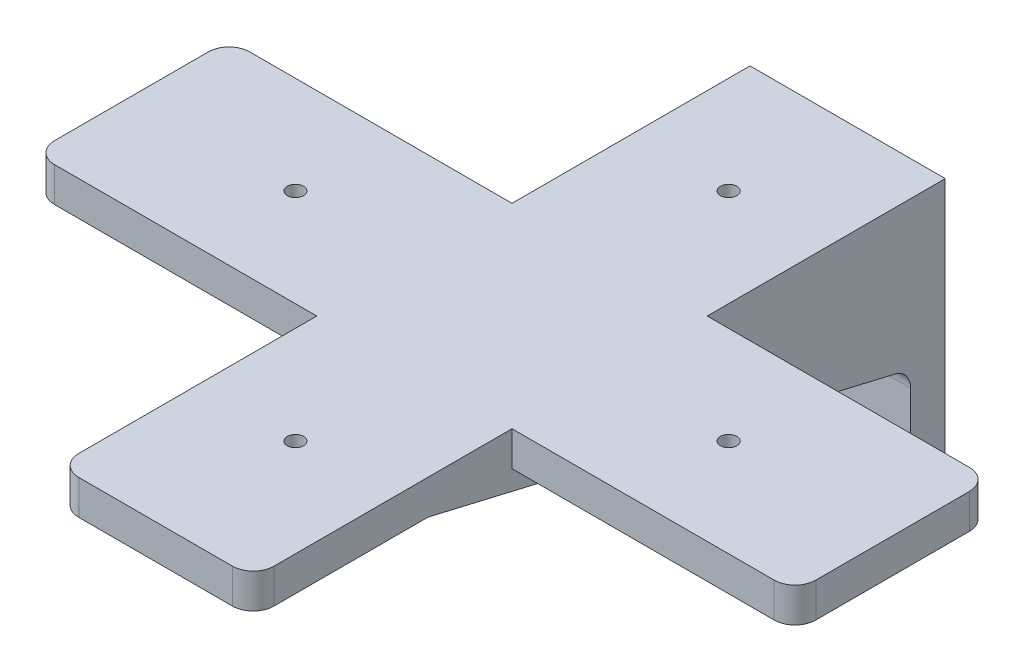
ISO-10303-21;
HEADER;
FILE_DESCRIPTION(('STEP AP214'),'2;1');
FILE_NAME('part.step','',(''),(''),'','','');
FILE_SCHEMA(('AUTOMOTIVE_DESIGN { 1 0 10303 214 1 1 1 1 }'));
ENDSEC;
DATA;
#1=APPLICATION_CONTEXT('core data for automotive mechanical design processes');
#2=APPLICATION_PROTOCOL_DEFINITION('international standard','automotive_design',2000,#1);
#3=PRODUCT_CONTEXT('',#1,'mechanical');
#4=PRODUCT('Part','Part','',(#3));
#5=PRODUCT_RELATED_PRODUCT_CATEGORY('part','',(#4));
#6=PRODUCT_DEFINITION_FORMATION('','',#4);
#7=PRODUCT_DEFINITION_CONTEXT('part definition',#1,'design');
#8=PRODUCT_DEFINITION('design','',#6,#7);
#9=PRODUCT_DEFINITION_SHAPE('','',#8);
#10=(LENGTH_UNIT() NAMED_UNIT(*) SI_UNIT(.MILLI.,.METRE.));
#11=(NAMED_UNIT(*) PLANE_ANGLE_UNIT() SI_UNIT($,.RADIAN.));
#12=(NAMED_UNIT(*) SI_UNIT($,.STERADIAN.) SOLID_ANGLE_UNIT());
#13=UNCERTAINTY_MEASURE_WITH_UNIT(LENGTH_MEASURE(1.E-05),#10,'distance_accuracy_value','');
#14=(GEOMETRIC_REPRESENTATION_CONTEXT(3) GLOBAL_UNCERTAINTY_ASSIGNED_CONTEXT((#13)) GLOBAL_UNIT_ASSIGNED_CONTEXT((#10,
#11,#12)) REPRESENTATION_CONTEXT('',''));
#15=CARTESIAN_POINT('',(0.,0.,0.));
#16=DIRECTION('',(0.,0.,1.));
#17=DIRECTION('',(1.,0.,0.));
#18=AXIS2_PLACEMENT_3D('',#15,#16,#17);
#19=CARTESIAN_POINT('',(0.,0.,6.35));
#20=DIRECTION('',(0.,0.,-1.));
#21=DIRECTION('',(-1.,0.,0.));
#22=AXIS2_PLACEMENT_3D('',#19,#20,#21);
#23=PLANE('',#22);
#24=DIRECTION('',(0.,-1.,0.));
#25=VECTOR('',#24,1.);
#26=CARTESIAN_POINT('',(-17.91335,-27.12085,6.35));
#27=LINE('',#26,#25);
#28=CARTESIAN_POINT('',(-17.91335,-3.01976470411475,6.35));
#29=VERTEX_POINT('',#28);
#30=CARTESIAN_POINT('',(-17.91335,-23.31085,6.35));
#31=VERTEX_POINT('',#30);
#32=EDGE_CURVE('E362',#29,#31,#27,.T.);
#33=ORIENTED_EDGE('',*,*,#32,.T.);
#34=CARTESIAN_POINT('',(-14.10335,-23.31085,6.35));
#35=DIRECTION('',(0.,0.,-1.));
#36=DIRECTION('',(-1.,0.,0.));
#37=AXIS2_PLACEMENT_3D('',#34,#35,#36);
#38=CIRCLE('',#37,3.81);
#39=CARTESIAN_POINT('',(-14.10335,-27.12085,6.35));
#40=VERTEX_POINT('',#39);
#41=EDGE_CURVE('E408',#31,#40,#38,.F.);
#42=ORIENTED_EDGE('',*,*,#41,.T.);
#43=DIRECTION('',(1.,0.,0.));
#44=VECTOR('',#43,1.);
#45=CARTESIAN_POINT('',(-17.91335,-27.12085,6.35));
#46=LINE('',#45,#44);
#47=CARTESIAN_POINT('',(14.10335,-27.12085,6.35));
#48=VERTEX_POINT('',#47);
#49=EDGE_CURVE('E366',#40,#48,#46,.T.);
#50=ORIENTED_EDGE('',*,*,#49,.T.);
#51=CARTESIAN_POINT('',(14.10335,-23.31085,6.35));
#52=DIRECTION('',(0.,0.,-1.));
#53=DIRECTION('',(-1.,0.,0.));
#54=AXIS2_PLACEMENT_3D('',#51,#52,#53);
#55=CIRCLE('',#54,3.81);
#56=CARTESIAN_POINT('',(17.91335,-23.31085,6.35));
#57=VERTEX_POINT('',#56);
#58=EDGE_CURVE('E406',#48,#57,#55,.F.);
#59=ORIENTED_EDGE('',*,*,#58,.T.);
#60=DIRECTION('',(0.,1.,0.));
#61=VECTOR('',#60,1.);
#62=CARTESIAN_POINT('',(17.91335,-27.12085,6.35));
#63=LINE('',#62,#61);
#64=CARTESIAN_POINT('',(17.91335,-3.01976470411475,6.35));
#65=VERTEX_POINT('',#64);
#66=EDGE_CURVE('E359',#57,#65,#63,.T.);
#67=ORIENTED_EDGE('',*,*,#66,.T.);
#68=DIRECTION('',(1.,0.,0.));
#69=VECTOR('',#68,1.);
#70=CARTESIAN_POINT('',(0.,-3.01976470411475,6.35));
#71=LINE('',#70,#69);
#72=CARTESIAN_POINT('',(12.83335,-3.01976470411475,6.35));
#73=VERTEX_POINT('',#72);
#74=EDGE_CURVE('E403',#65,#73,#71,.F.);
#75=ORIENTED_EDGE('',*,*,#74,.T.);
#76=DIRECTION('',(0.,1.,0.));
#77=VECTOR('',#76,1.);
#78=CARTESIAN_POINT('',(12.83335,20.77085,6.35));
#79=LINE('',#78,#77);
#80=CARTESIAN_POINT('',(12.83335,20.77085,6.35));
#81=VERTEX_POINT('',#80);
#82=EDGE_CURVE('E333',#73,#81,#79,.T.);
#83=ORIENTED_EDGE('',*,*,#82,.T.);
#84=DIRECTION('',(-1.,0.,0.));
#85=VECTOR('',#84,1.);
#86=CARTESIAN_POINT('',(0.,20.77085,6.35));
#87=LINE('',#86,#85);
#88=CARTESIAN_POINT('',(-12.83335,20.77085,6.35));
#89=VERTEX_POINT('',#88);
#90=EDGE_CURVE('E353',#81,#89,#87,.T.);
#91=ORIENTED_EDGE('',*,*,#90,.T.);
#92=DIRECTION('',(0.,1.,0.));
#93=VECTOR('',#92,1.);
#94=CARTESIAN_POINT('',(-12.83335,20.77085,6.35));
#95=LINE('',#94,#93);
#96=CARTESIAN_POINT('',(-12.83335,-3.01976470411475,6.35));
#97=VERTEX_POINT('',#96);
#98=EDGE_CURVE('E323',#97,#89,#95,.T.);
#99=ORIENTED_EDGE('',*,*,#98,.F.);
#100=DIRECTION('',(-1.,0.,0.));
#101=VECTOR('',#100,1.);
#102=CARTESIAN_POINT('',(-17.91335,-3.01976470411475,6.35));
#103=LINE('',#102,#101);
#104=EDGE_CURVE('E400',#97,#29,#103,.T.);
#105=ORIENTED_EDGE('',*,*,#104,.T.);
#106=EDGE_LOOP('',(#33,#42,#50,#59,#67,#75,#83,#91,#99,#105));
#107=FACE_BOUND('',#106,.T.);
#108=ADVANCED_FACE('F33',(#107),#23,.F.);
#109=CARTESIAN_POINT('',(0.,20.77085,0.));
#110=DIRECTION('',(0.,-1.,0.));
#111=DIRECTION('',(0.,0.,-1.));
#112=AXIS2_PLACEMENT_3D('',#109,#110,#111);
#113=PLANE('',#112);
#114=CARTESIAN_POINT('',(1.96755585373371E-12,20.77085,101.349175));
#115=DIRECTION('',(0.,1.,0.));
#116=DIRECTION('',(0.,0.,1.));
#117=AXIS2_PLACEMENT_3D('',#114,#115,#116);
#118=CIRCLE('',#117,1.4986);
#119=CARTESIAN_POINT('',(1.96755585373371E-12,20.77085,102.847775));
#120=VERTEX_POINT('',#119);
#121=EDGE_CURVE('E889',#120,#120,#118,.T.);
#122=ORIENTED_EDGE('',*,*,#121,.T.);
#123=EDGE_LOOP('',(#122));
#124=FACE_BOUND('',#123,.T.);
#125=CARTESIAN_POINT('',(0.,20.77085,21.840825));
#126=DIRECTION('',(0.,1.,0.));
#127=DIRECTION('',(0.,0.,1.));
#128=AXIS2_PLACEMENT_3D('',#125,#126,#127);
#129=CIRCLE('',#128,1.4986);
#130=CARTESIAN_POINT('',(0.,20.77085,23.339425));
#131=VERTEX_POINT('',#130);
#132=EDGE_CURVE('E284',#131,#131,#129,.T.);
#133=ORIENTED_EDGE('',*,*,#132,.T.);
#134=EDGE_LOOP('',(#133));
#135=FACE_BOUND('',#134,.T.);
#136=DIRECTION('',(0.,0.,1.));
#137=VECTOR('',#136,1.);
#138=CARTESIAN_POINT('',(12.83335,20.77085,94.9064462382413));
#139=LINE('',#138,#137);
#140=CARTESIAN_POINT('',(12.83335,20.77085,95.3472808215336));
#141=VERTEX_POINT('',#140);
#142=EDGE_CURVE('E336',#81,#141,#139,.T.);
#143=ORIENTED_EDGE('',*,*,#142,.T.);
#144=DIRECTION('',(1.,0.,0.));
#145=VECTOR('',#144,1.);
#146=CARTESIAN_POINT('',(17.91335,20.77085,95.3472808215336));
#147=LINE('',#146,#145);
#148=CARTESIAN_POINT('',(17.91335,20.77085,95.3472808215336));
#149=VERTEX_POINT('',#148);
#150=EDGE_CURVE('E427',#141,#149,#147,.T.);
#151=ORIENTED_EDGE('',*,*,#150,.T.);
#152=DIRECTION('',(0.,0.,-1.));
#153=VECTOR('',#152,1.);
#154=CARTESIAN_POINT('',(17.91335,20.77085,127.));
#155=LINE('',#154,#153);
#156=CARTESIAN_POINT('',(17.91335,20.77085,123.19));
#157=VERTEX_POINT('',#156);
#158=EDGE_CURVE('E350',#157,#149,#155,.T.);
#159=ORIENTED_EDGE('',*,*,#158,.F.);
#160=CARTESIAN_POINT('',(14.10335,20.77085,123.19));
#161=DIRECTION('',(0.,-1.,0.));
#162=DIRECTION('',(0.,0.,-1.));
#163=AXIS2_PLACEMENT_3D('',#160,#161,#162);
#164=CIRCLE('',#163,3.81);
#165=CARTESIAN_POINT('',(14.10335,20.77085,127.));
#166=VERTEX_POINT('',#165);
#167=EDGE_CURVE('E432',#157,#166,#164,.T.);
#168=ORIENTED_EDGE('',*,*,#167,.T.);
#169=DIRECTION('',(1.,0.,0.));
#170=VECTOR('',#169,1.);
#171=CARTESIAN_POINT('',(-17.91335,20.77085,127.));
#172=LINE('',#171,#170);
#173=CARTESIAN_POINT('',(-14.10335,20.77085,127.));
#174=VERTEX_POINT('',#173);
#175=EDGE_CURVE('E347',#174,#166,#172,.T.);
#176=ORIENTED_EDGE('',*,*,#175,.F.);
#177=CARTESIAN_POINT('',(-14.10335,20.77085,123.19));
#178=DIRECTION('',(0.,-1.,0.));
#179=DIRECTION('',(0.,0.,-1.));
#180=AXIS2_PLACEMENT_3D('',#177,#178,#179);
#181=CIRCLE('',#180,3.81);
#182=CARTESIAN_POINT('',(-17.91335,20.77085,123.19));
#183=VERTEX_POINT('',#182);
#184=EDGE_CURVE('E430',#174,#183,#181,.T.);
#185=ORIENTED_EDGE('',*,*,#184,.T.);
#186=DIRECTION('',(0.,0.,1.));
#187=VECTOR('',#186,1.);
#188=CARTESIAN_POINT('',(-17.91335,20.77085,127.));
#189=LINE('',#188,#187);
#190=CARTESIAN_POINT('',(-17.91335,20.77085,95.3472808215336));
#191=VERTEX_POINT('',#190);
#192=EDGE_CURVE('E344',#191,#183,#189,.T.);
#193=ORIENTED_EDGE('',*,*,#192,.F.);
#194=DIRECTION('',(-1.,0.,0.));
#195=VECTOR('',#194,1.);
#196=CARTESIAN_POINT('',(0.,20.77085,95.3472808215336));
#197=LINE('',#196,#195);
#198=CARTESIAN_POINT('',(-12.83335,20.77085,95.3472808215336));
#199=VERTEX_POINT('',#198);
#200=EDGE_CURVE('E424',#191,#199,#197,.F.);
#201=ORIENTED_EDGE('',*,*,#200,.T.);
#202=DIRECTION('',(0.,0.,1.));
#203=VECTOR('',#202,1.);
#204=CARTESIAN_POINT('',(-12.83335,20.77085,94.9064462382413));
#205=LINE('',#204,#203);
#206=EDGE_CURVE('E328',#89,#199,#205,.T.);
#207=ORIENTED_EDGE('',*,*,#206,.F.);
#208=ORIENTED_EDGE('',*,*,#90,.F.);
#209=EDGE_LOOP('',(#143,#151,#159,#168,#176,#185,#193,#201,#207,#208));
#210=FACE_BOUND('',#209,.T.);
#211=ADVANCED_FACE('F515',(#124,#135,#210),#113,.T.);
#212=CARTESIAN_POINT('',(17.91335,-27.12085,6.35));
#213=DIRECTION('',(-1.,0.,0.));
#214=DIRECTION('',(0.,0.,1.));
#215=AXIS2_PLACEMENT_3D('',#212,#213,#214);
#216=PLANE('',#215);
#217=DIRECTION('',(0.,0.,-1.));
#218=VECTOR('',#217,1.);
#219=CARTESIAN_POINT('',(17.91335,20.77085,6.35));
#220=LINE('',#219,#218);
#221=CARTESIAN_POINT('',(17.91335,20.77085,79.50835));
#222=VERTEX_POINT('',#221);
#223=CARTESIAN_POINT('',(17.91335,20.77085,43.68165));
#224=VERTEX_POINT('',#223);
#225=EDGE_CURVE('E314',#222,#224,#220,.T.);
#226=ORIENTED_EDGE('',*,*,#225,.F.);
#227=DIRECTION('',(0.,1.,0.));
#228=VECTOR('',#227,1.);
#229=CARTESIAN_POINT('',(17.91335,-27.12085,79.50835));
#230=LINE('',#229,#228);
#231=CARTESIAN_POINT('',(17.91335,27.12085,79.50835));
#232=VERTEX_POINT('',#231);
#233=EDGE_CURVE('E319',#222,#232,#230,.T.);
#234=ORIENTED_EDGE('',*,*,#233,.T.);
#235=DIRECTION('',(0.,0.,-1.));
#236=VECTOR('',#235,1.);
#237=CARTESIAN_POINT('',(17.91335,27.12085,6.35));
#238=LINE('',#237,#236);
#239=CARTESIAN_POINT('',(17.91335,27.12085,123.19));
#240=VERTEX_POINT('',#239);
#241=EDGE_CURVE('E383',#240,#232,#238,.T.);
#242=ORIENTED_EDGE('',*,*,#241,.F.);
#243=DIRECTION('',(0.,1.,0.));
#244=VECTOR('',#243,1.);
#245=CARTESIAN_POINT('',(17.91335,20.77085,123.19));
#246=LINE('',#245,#244);
#247=EDGE_CURVE('E410',#240,#157,#246,.F.);
#248=ORIENTED_EDGE('',*,*,#247,.T.);
#249=ORIENTED_EDGE('',*,*,#158,.T.);
#250=CARTESIAN_POINT('',(17.91335,16.96085,95.3472808215336));
#251=DIRECTION('',(-1.,0.,0.));
#252=DIRECTION('',(0.,0.,1.));
#253=AXIS2_PLACEMENT_3D('',#250,#251,#252);
#254=CIRCLE('',#253,3.81);
#255=CARTESIAN_POINT('',(17.91335,20.6701844740513,94.4772591208765));
#256=VERTEX_POINT('',#255);
#257=EDGE_CURVE('E444',#149,#256,#254,.T.);
#258=ORIENTED_EDGE('',*,*,#257,.T.);
#259=DIRECTION('',(0.,-0.228352152403454,-0.973578602113209));
#260=VECTOR('',#259,1.);
#261=CARTESIAN_POINT('',(17.91335,0.,6.35));
#262=LINE('',#261,#260);
#263=CARTESIAN_POINT('',(17.91335,0.689569769936577,9.28997829934284));
#264=VERTEX_POINT('',#263);
#265=EDGE_CURVE('E330',#256,#264,#262,.T.);
#266=ORIENTED_EDGE('',*,*,#265,.T.);
#267=CARTESIAN_POINT('',(17.91335,-3.01976470411475,10.16));
#268=DIRECTION('',(-1.,0.,0.));
#269=DIRECTION('',(0.,0.,1.));
#270=AXIS2_PLACEMENT_3D('',#267,#268,#269);
#271=CIRCLE('',#270,3.81);
#272=EDGE_CURVE('E453',#264,#65,#271,.T.);
#273=ORIENTED_EDGE('',*,*,#272,.T.);
#274=ORIENTED_EDGE('',*,*,#66,.F.);
#275=DIRECTION('',(0.,0.,-1.));
#276=VECTOR('',#275,1.);
#277=CARTESIAN_POINT('',(17.91335,-23.31085,6.35));
#278=LINE('',#277,#276);
#279=CARTESIAN_POINT('',(17.91335,-23.31085,0.));
#280=VERTEX_POINT('',#279);
#281=EDGE_CURVE('E412',#57,#280,#278,.T.);
#282=ORIENTED_EDGE('',*,*,#281,.T.);
#283=DIRECTION('',(0.,1.,0.));
#284=VECTOR('',#283,1.);
#285=CARTESIAN_POINT('',(17.91335,-27.12085,0.));
#286=LINE('',#285,#284);
#287=CARTESIAN_POINT('',(17.91335,27.12085,0.));
#288=VERTEX_POINT('',#287);
#289=EDGE_CURVE('E358',#280,#288,#286,.T.);
#290=ORIENTED_EDGE('',*,*,#289,.T.);
#291=CARTESIAN_POINT('',(17.91335,27.12085,43.68165));
#292=VERTEX_POINT('',#291);
#293=EDGE_CURVE('E382',#292,#288,#238,.T.);
#294=ORIENTED_EDGE('',*,*,#293,.F.);
#295=DIRECTION('',(0.,-1.,0.));
#296=VECTOR('',#295,1.);
#297=CARTESIAN_POINT('',(17.91335,-27.12085,43.68165));
#298=LINE('',#297,#296);
#299=EDGE_CURVE('E316',#292,#224,#298,.T.);
#300=ORIENTED_EDGE('',*,*,#299,.T.);
#301=EDGE_LOOP('',(#226,#234,#242,#248,#249,#258,#266,#273,#274,#282,#290,#294,#300));
#302=FACE_BOUND('',#301,.T.);
#303=ADVANCED_FACE('F497',(#302),#216,.F.);
#304=CARTESIAN_POINT('',(-17.91335,27.12085,6.35));
#305=DIRECTION('',(0.,-1.,0.));
#306=DIRECTION('',(0.,0.,-1.));
#307=AXIS2_PLACEMENT_3D('',#304,#305,#306);
#308=PLANE('',#307);
#309=CARTESIAN_POINT('',(-39.7541749999989,27.12085,61.5950000000007));
#310=DIRECTION('',(0.,1.,0.));
#311=DIRECTION('',(0.,0.,1.));
#312=AXIS2_PLACEMENT_3D('',#309,#310,#311);
#313=CIRCLE('',#312,1.4986);
#314=CARTESIAN_POINT('',(-39.7541749999989,27.12085,63.0936000000007));
#315=VERTEX_POINT('',#314);
#316=EDGE_CURVE('E884',#315,#315,#313,.T.);
#317=ORIENTED_EDGE('',*,*,#316,.F.);
#318=EDGE_LOOP('',(#317));
#319=FACE_BOUND('',#318,.T.);
#320=CARTESIAN_POINT('',(1.96755585373371E-12,27.12085,101.349175));
#321=DIRECTION('',(0.,1.,0.));
#322=DIRECTION('',(0.,0.,1.));
#323=AXIS2_PLACEMENT_3D('',#320,#321,#322);
#324=CIRCLE('',#323,1.4986);
#325=CARTESIAN_POINT('',(1.96755585373371E-12,27.12085,102.847775));
#326=VERTEX_POINT('',#325);
#327=EDGE_CURVE('E886',#326,#326,#324,.T.);
#328=ORIENTED_EDGE('',*,*,#327,.F.);
#329=EDGE_LOOP('',(#328));
#330=FACE_BOUND('',#329,.T.);
#331=CARTESIAN_POINT('',(39.7541750000011,27.12085,61.594999999999));
#332=DIRECTION('',(0.,1.,0.));
#333=DIRECTION('',(0.,0.,1.));
#334=AXIS2_PLACEMENT_3D('',#331,#332,#333);
#335=CIRCLE('',#334,1.49859999999999);
#336=CARTESIAN_POINT('',(39.7541750000011,27.12085,63.093599999999));
#337=VERTEX_POINT('',#336);
#338=EDGE_CURVE('E892',#337,#337,#335,.T.);
#339=ORIENTED_EDGE('',*,*,#338,.F.);
#340=EDGE_LOOP('',(#339));
#341=FACE_BOUND('',#340,.T.);
#342=CARTESIAN_POINT('',(0.,27.12085,21.840825));
#343=DIRECTION('',(0.,1.,0.));
#344=DIRECTION('',(0.,0.,1.));
#345=AXIS2_PLACEMENT_3D('',#342,#343,#344);
#346=CIRCLE('',#345,1.4986);
#347=CARTESIAN_POINT('',(0.,27.12085,23.339425));
#348=VERTEX_POINT('',#347);
#349=EDGE_CURVE('E262',#348,#348,#346,.T.);
#350=ORIENTED_EDGE('',*,*,#349,.F.);
#351=EDGE_LOOP('',(#350));
#352=FACE_BOUND('',#351,.T.);
#353=DIRECTION('',(0.,0.,-1.));
#354=VECTOR('',#353,1.);
#355=CARTESIAN_POINT('',(-17.91335,27.12085,6.35));
#356=LINE('',#355,#354);
#357=CARTESIAN_POINT('',(-17.91335,27.12085,43.68165));
#358=VERTEX_POINT('',#357);
#359=CARTESIAN_POINT('',(-17.91335,27.12085,0.));
#360=VERTEX_POINT('',#359);
#361=EDGE_CURVE('E369',#358,#360,#356,.T.);
#362=ORIENTED_EDGE('',*,*,#361,.F.);
#363=DIRECTION('',(-1.,0.,0.));
#364=VECTOR('',#363,1.);
#365=CARTESIAN_POINT('',(-66.04,27.12085,43.68165));
#366=LINE('',#365,#364);
#367=CARTESIAN_POINT('',(-66.04,27.12085,43.68165));
#368=VERTEX_POINT('',#367);
#369=EDGE_CURVE('E288',#358,#368,#366,.T.);
#370=ORIENTED_EDGE('',*,*,#369,.T.);
#371=CARTESIAN_POINT('',(-66.04,27.12085,47.49165));
#372=DIRECTION('',(0.,1.,0.));
#373=DIRECTION('',(0.,0.,-1.));
#374=AXIS2_PLACEMENT_3D('',#371,#372,#373);
#375=CIRCLE('',#374,3.81);
#376=CARTESIAN_POINT('',(-69.85,27.12085,47.49165));
#377=VERTEX_POINT('',#376);
#378=EDGE_CURVE('E290',#368,#377,#375,.T.);
#379=ORIENTED_EDGE('',*,*,#378,.T.);
#380=DIRECTION('',(0.,0.,1.));
#381=VECTOR('',#380,1.);
#382=CARTESIAN_POINT('',(-69.85,27.12085,75.69835));
#383=LINE('',#382,#381);
#384=CARTESIAN_POINT('',(-69.85,27.12085,75.69835));
#385=VERTEX_POINT('',#384);
#386=EDGE_CURVE('E293',#377,#385,#383,.T.);
#387=ORIENTED_EDGE('',*,*,#386,.T.);
#388=CARTESIAN_POINT('',(-66.04,27.12085,75.69835));
#389=DIRECTION('',(0.,1.,0.));
#390=DIRECTION('',(0.,0.,-1.));
#391=AXIS2_PLACEMENT_3D('',#388,#389,#390);
#392=CIRCLE('',#391,3.81);
#393=CARTESIAN_POINT('',(-66.04,27.12085,79.50835));
#394=VERTEX_POINT('',#393);
#395=EDGE_CURVE('E296',#385,#394,#392,.T.);
#396=ORIENTED_EDGE('',*,*,#395,.T.);
#397=DIRECTION('',(1.,0.,0.));
#398=VECTOR('',#397,1.);
#399=CARTESIAN_POINT('',(-66.04,27.12085,79.50835));
#400=LINE('',#399,#398);
#401=CARTESIAN_POINT('',(-17.91335,27.12085,79.50835));
#402=VERTEX_POINT('',#401);
#403=EDGE_CURVE('E256',#394,#402,#400,.T.);
#404=ORIENTED_EDGE('',*,*,#403,.T.);
#405=CARTESIAN_POINT('',(-17.91335,27.12085,123.19));
#406=VERTEX_POINT('',#405);
#407=EDGE_CURVE('E380',#406,#402,#356,.T.);
#408=ORIENTED_EDGE('',*,*,#407,.F.);
#409=CARTESIAN_POINT('',(-14.10335,27.12085,123.19));
#410=DIRECTION('',(0.,-1.,0.));
#411=DIRECTION('',(0.,0.,-1.));
#412=AXIS2_PLACEMENT_3D('',#409,#410,#411);
#413=CIRCLE('',#412,3.81);
#414=CARTESIAN_POINT('',(-14.10335,27.12085,127.));
#415=VERTEX_POINT('',#414);
#416=EDGE_CURVE('E420',#406,#415,#413,.F.);
#417=ORIENTED_EDGE('',*,*,#416,.T.);
#418=DIRECTION('',(1.,0.,0.));
#419=VECTOR('',#418,1.);
#420=CARTESIAN_POINT('',(-17.91335,27.12085,127.));
#421=LINE('',#420,#419);
#422=CARTESIAN_POINT('',(14.10335,27.12085,127.));
#423=VERTEX_POINT('',#422);
#424=EDGE_CURVE('E341',#415,#423,#421,.T.);
#425=ORIENTED_EDGE('',*,*,#424,.T.);
#426=CARTESIAN_POINT('',(14.10335,27.12085,123.19));
#427=DIRECTION('',(0.,-1.,0.));
#428=DIRECTION('',(0.,0.,-1.));
#429=AXIS2_PLACEMENT_3D('',#426,#427,#428);
#430=CIRCLE('',#429,3.81);
#431=EDGE_CURVE('E422',#423,#240,#430,.F.);
#432=ORIENTED_EDGE('',*,*,#431,.T.);
#433=ORIENTED_EDGE('',*,*,#241,.T.);
#434=CARTESIAN_POINT('',(66.04,27.12085,79.50835));
#435=VERTEX_POINT('',#434);
#436=EDGE_CURVE('E259',#232,#435,#400,.T.);
#437=ORIENTED_EDGE('',*,*,#436,.T.);
#438=CARTESIAN_POINT('',(66.04,27.12085,75.69835));
#439=DIRECTION('',(0.,1.,0.));
#440=DIRECTION('',(0.,0.,1.));
#441=AXIS2_PLACEMENT_3D('',#438,#439,#440);
#442=CIRCLE('',#441,3.81);
#443=CARTESIAN_POINT('',(69.85,27.12085,75.69835));
#444=VERTEX_POINT('',#443);
#445=EDGE_CURVE('E282',#435,#444,#442,.T.);
#446=ORIENTED_EDGE('',*,*,#445,.T.);
#447=DIRECTION('',(0.,0.,-1.));
#448=VECTOR('',#447,1.);
#449=CARTESIAN_POINT('',(69.85,27.12085,75.69835));
#450=LINE('',#449,#448);
#451=CARTESIAN_POINT('',(69.85,27.12085,47.49165));
#452=VERTEX_POINT('',#451);
#453=EDGE_CURVE('E234',#444,#452,#450,.T.);
#454=ORIENTED_EDGE('',*,*,#453,.T.);
#455=CARTESIAN_POINT('',(66.04,27.12085,47.49165));
#456=DIRECTION('',(0.,1.,0.));
#457=DIRECTION('',(0.,0.,-1.));
#458=AXIS2_PLACEMENT_3D('',#455,#456,#457);
#459=CIRCLE('',#458,3.81);
#460=CARTESIAN_POINT('',(66.04,27.12085,43.68165));
#461=VERTEX_POINT('',#460);
#462=EDGE_CURVE('E286',#452,#461,#459,.T.);
#463=ORIENTED_EDGE('',*,*,#462,.T.);
#464=EDGE_CURVE('E48',#461,#292,#366,.T.);
#465=ORIENTED_EDGE('',*,*,#464,.T.);
#466=ORIENTED_EDGE('',*,*,#293,.T.);
#467=DIRECTION('',(-1.,0.,0.));
#468=VECTOR('',#467,1.);
#469=CARTESIAN_POINT('',(-17.91335,27.12085,0.));
#470=LINE('',#469,#468);
#471=EDGE_CURVE('E372',#288,#360,#470,.T.);
#472=ORIENTED_EDGE('',*,*,#471,.T.);
#473=EDGE_LOOP('',(#362,#370,#379,#387,#396,#404,#408,#417,#425,#432,#433,#437,#446,#454,#463,
#465,#466,#472));
#474=FACE_BOUND('',#473,.T.);
#475=ADVANCED_FACE('F470',(#319,#330,#341,#352,#474),#308,.F.);
#476=CARTESIAN_POINT('',(-17.91335,-27.12085,6.35));
#477=DIRECTION('',(1.,0.,0.));
#478=DIRECTION('',(0.,0.,-1.));
#479=AXIS2_PLACEMENT_3D('',#476,#477,#478);
#480=PLANE('',#479);
#481=ORIENTED_EDGE('',*,*,#407,.T.);
#482=DIRECTION('',(0.,-1.,0.));
#483=VECTOR('',#482,1.);
#484=CARTESIAN_POINT('',(-17.91335,-27.12085,79.50835));
#485=LINE('',#484,#483);
#486=CARTESIAN_POINT('',(-17.91335,20.77085,79.50835));
#487=VERTEX_POINT('',#486);
#488=EDGE_CURVE('E11',#402,#487,#485,.T.);
#489=ORIENTED_EDGE('',*,*,#488,.T.);
#490=DIRECTION('',(0.,0.,1.));
#491=VECTOR('',#490,1.);
#492=CARTESIAN_POINT('',(-17.91335,20.77085,6.35));
#493=LINE('',#492,#491);
#494=CARTESIAN_POINT('',(-17.91335,20.77085,43.68165));
#495=VERTEX_POINT('',#494);
#496=EDGE_CURVE('E300',#495,#487,#493,.T.);
#497=ORIENTED_EDGE('',*,*,#496,.F.);
#498=DIRECTION('',(0.,1.,0.));
#499=VECTOR('',#498,1.);
#500=CARTESIAN_POINT('',(-17.91335,-27.12085,43.68165));
#501=LINE('',#500,#499);
#502=EDGE_CURVE('E41',#495,#358,#501,.T.);
#503=ORIENTED_EDGE('',*,*,#502,.T.);
#504=ORIENTED_EDGE('',*,*,#361,.T.);
#505=DIRECTION('',(0.,-1.,0.));
#506=VECTOR('',#505,1.);
#507=CARTESIAN_POINT('',(-17.91335,-27.12085,0.));
#508=LINE('',#507,#506);
#509=CARTESIAN_POINT('',(-17.91335,-23.31085,0.));
#510=VERTEX_POINT('',#509);
#511=EDGE_CURVE('E375',#360,#510,#508,.T.);
#512=ORIENTED_EDGE('',*,*,#511,.T.);
#513=DIRECTION('',(0.,0.,-1.));
#514=VECTOR('',#513,1.);
#515=CARTESIAN_POINT('',(-17.91335,-23.31085,6.35));
#516=LINE('',#515,#514);
#517=EDGE_CURVE('E398',#510,#31,#516,.F.);
#518=ORIENTED_EDGE('',*,*,#517,.T.);
#519=ORIENTED_EDGE('',*,*,#32,.F.);
#520=CARTESIAN_POINT('',(-17.91335,-3.01976470411475,10.16));
#521=DIRECTION('',(1.,0.,0.));
#522=DIRECTION('',(0.,0.,-1.));
#523=AXIS2_PLACEMENT_3D('',#520,#521,#522);
#524=CIRCLE('',#523,3.81);
#525=CARTESIAN_POINT('',(-17.91335,0.689569769936577,9.28997829934284));
#526=VERTEX_POINT('',#525);
#527=EDGE_CURVE('E457',#29,#526,#524,.T.);
#528=ORIENTED_EDGE('',*,*,#527,.T.);
#529=DIRECTION('',(0.,-0.228352152403454,-0.973578602113209));
#530=VECTOR('',#529,1.);
#531=CARTESIAN_POINT('',(-17.91335,0.,6.35));
#532=LINE('',#531,#530);
#533=CARTESIAN_POINT('',(-17.91335,20.6701844740513,94.4772591208765));
#534=VERTEX_POINT('',#533);
#535=EDGE_CURVE('E322',#534,#526,#532,.T.);
#536=ORIENTED_EDGE('',*,*,#535,.F.);
#537=CARTESIAN_POINT('',(-17.91335,16.96085,95.3472808215336));
#538=DIRECTION('',(1.,0.,0.));
#539=DIRECTION('',(0.,0.,-1.));
#540=AXIS2_PLACEMENT_3D('',#537,#538,#539);
#541=CIRCLE('',#540,3.81);
#542=EDGE_CURVE('E449',#534,#191,#541,.T.);
#543=ORIENTED_EDGE('',*,*,#542,.T.);
#544=ORIENTED_EDGE('',*,*,#192,.T.);
#545=DIRECTION('',(0.,1.,0.));
#546=VECTOR('',#545,1.);
#547=CARTESIAN_POINT('',(-17.91335,27.12085,123.19));
#548=LINE('',#547,#546);
#549=EDGE_CURVE('E395',#183,#406,#548,.T.);
#550=ORIENTED_EDGE('',*,*,#549,.T.);
#551=EDGE_LOOP('',(#481,#489,#497,#503,#504,#512,#518,#519,#528,#536,#543,#544,#550));
#552=FACE_BOUND('',#551,.T.);
#553=ADVANCED_FACE('F464',(#552),#480,.F.);
#554=CARTESIAN_POINT('',(-17.91335,-27.12085,6.35));
#555=DIRECTION('',(0.,1.,0.));
#556=DIRECTION('',(0.,0.,1.));
#557=AXIS2_PLACEMENT_3D('',#554,#555,#556);
#558=PLANE('',#557);
#559=ORIENTED_EDGE('',*,*,#49,.F.);
#560=DIRECTION('',(0.,0.,-1.));
#561=VECTOR('',#560,1.);
#562=CARTESIAN_POINT('',(-14.10335,-27.12085,6.35));
#563=LINE('',#562,#561);
#564=CARTESIAN_POINT('',(-14.10335,-27.12085,0.));
#565=VERTEX_POINT('',#564);
#566=EDGE_CURVE('E388',#40,#565,#563,.T.);
#567=ORIENTED_EDGE('',*,*,#566,.T.);
#568=DIRECTION('',(1.,0.,0.));
#569=VECTOR('',#568,1.);
#570=CARTESIAN_POINT('',(-17.91335,-27.12085,0.));
#571=LINE('',#570,#569);
#572=CARTESIAN_POINT('',(14.10335,-27.12085,0.));
#573=VERTEX_POINT('',#572);
#574=EDGE_CURVE('E363',#565,#573,#571,.T.);
#575=ORIENTED_EDGE('',*,*,#574,.T.);
#576=DIRECTION('',(0.,0.,-1.));
#577=VECTOR('',#576,1.);
#578=CARTESIAN_POINT('',(14.10335,-27.12085,6.35));
#579=LINE('',#578,#577);
#580=EDGE_CURVE('E386',#573,#48,#579,.F.);
#581=ORIENTED_EDGE('',*,*,#580,.T.);
#582=EDGE_LOOP('',(#559,#567,#575,#581));
#583=FACE_BOUND('',#582,.T.);
#584=ADVANCED_FACE('F488',(#583),#558,.F.);
#585=CARTESIAN_POINT('',(0.,0.,0.));
#586=DIRECTION('',(0.,0.,-1.));
#587=DIRECTION('',(-1.,0.,0.));
#588=AXIS2_PLACEMENT_3D('',#585,#586,#587);
#589=PLANE('',#588);
#590=ORIENTED_EDGE('',*,*,#574,.F.);
#591=CARTESIAN_POINT('',(-14.10335,-23.31085,0.));
#592=DIRECTION('',(0.,0.,-1.));
#593=DIRECTION('',(-1.,0.,0.));
#594=AXIS2_PLACEMENT_3D('',#591,#592,#593);
#595=CIRCLE('',#594,3.81);
#596=EDGE_CURVE('E393',#565,#510,#595,.T.);
#597=ORIENTED_EDGE('',*,*,#596,.T.);
#598=ORIENTED_EDGE('',*,*,#511,.F.);
#599=ORIENTED_EDGE('',*,*,#471,.F.);
#600=ORIENTED_EDGE('',*,*,#289,.F.);
#601=CARTESIAN_POINT('',(14.10335,-23.31085,0.));
#602=DIRECTION('',(0.,0.,-1.));
#603=DIRECTION('',(-1.,0.,0.));
#604=AXIS2_PLACEMENT_3D('',#601,#602,#603);
#605=CIRCLE('',#604,3.81);
#606=EDGE_CURVE('E391',#280,#573,#605,.T.);
#607=ORIENTED_EDGE('',*,*,#606,.T.);
#608=EDGE_LOOP('',(#590,#597,#598,#599,#600,#607));
#609=FACE_BOUND('',#608,.T.);
#610=ADVANCED_FACE('F477',(#609),#589,.T.);
#611=CARTESIAN_POINT('',(-17.91335,20.77085,127.));
#612=DIRECTION('',(0.,0.,1.));
#613=DIRECTION('',(1.,0.,0.));
#614=AXIS2_PLACEMENT_3D('',#611,#612,#613);
#615=PLANE('',#614);
#616=ORIENTED_EDGE('',*,*,#175,.T.);
#617=DIRECTION('',(0.,1.,0.));
#618=VECTOR('',#617,1.);
#619=CARTESIAN_POINT('',(14.10335,27.12085,127.));
#620=LINE('',#619,#618);
#621=EDGE_CURVE('E417',#166,#423,#620,.T.);
#622=ORIENTED_EDGE('',*,*,#621,.T.);
#623=ORIENTED_EDGE('',*,*,#424,.F.);
#624=DIRECTION('',(0.,1.,0.));
#625=VECTOR('',#624,1.);
#626=CARTESIAN_POINT('',(-14.10335,20.77085,127.));
#627=LINE('',#626,#625);
#628=EDGE_CURVE('E415',#415,#174,#627,.F.);
#629=ORIENTED_EDGE('',*,*,#628,.T.);
#630=EDGE_LOOP('',(#616,#622,#623,#629));
#631=FACE_BOUND('',#630,.T.);
#632=ADVANCED_FACE('F526',(#631),#615,.T.);
#633=CARTESIAN_POINT('',(12.83335,0.,6.35));
#634=DIRECTION('',(0.,-0.973578602113209,0.228352152403454));
#635=DIRECTION('',(0.,-0.228352152403454,-0.973578602113209));
#636=AXIS2_PLACEMENT_3D('',#633,#634,#635);
#637=PLANE('',#636);
#638=ORIENTED_EDGE('',*,*,#265,.F.);
#639=DIRECTION('',(1.,0.,0.));
#640=VECTOR('',#639,1.);
#641=CARTESIAN_POINT('',(12.83335,20.6701844740513,94.4772591208764));
#642=LINE('',#641,#640);
#643=CARTESIAN_POINT('',(12.83335,20.6701844740513,94.4772591208765));
#644=VERTEX_POINT('',#643);
#645=EDGE_CURVE('E437',#256,#644,#642,.F.);
#646=ORIENTED_EDGE('',*,*,#645,.T.);
#647=DIRECTION('',(0.,-0.228352152403454,-0.973578602113209));
#648=VECTOR('',#647,1.);
#649=CARTESIAN_POINT('',(12.83335,0.,6.35));
#650=LINE('',#649,#648);
#651=CARTESIAN_POINT('',(12.83335,0.689569769936577,9.28997829934284));
#652=VERTEX_POINT('',#651);
#653=EDGE_CURVE('E338',#644,#652,#650,.T.);
#654=ORIENTED_EDGE('',*,*,#653,.T.);
#655=DIRECTION('',(1.,0.,0.));
#656=VECTOR('',#655,1.);
#657=CARTESIAN_POINT('',(12.83335,0.689569769936577,9.28997829934284));
#658=LINE('',#657,#656);
#659=EDGE_CURVE('E434',#652,#264,#658,.T.);
#660=ORIENTED_EDGE('',*,*,#659,.T.);
#661=EDGE_LOOP('',(#638,#646,#654,#660));
#662=FACE_BOUND('',#661,.T.);
#663=ADVANCED_FACE('F504',(#662),#637,.T.);
#664=CARTESIAN_POINT('',(12.83335,0.,0.));
#665=DIRECTION('',(1.,0.,0.));
#666=DIRECTION('',(0.,0.,-1.));
#667=AXIS2_PLACEMENT_3D('',#664,#665,#666);
#668=PLANE('',#667);
#669=ORIENTED_EDGE('',*,*,#82,.F.);
#670=CARTESIAN_POINT('',(12.83335,-3.01976470411475,10.16));
#671=DIRECTION('',(1.,0.,0.));
#672=DIRECTION('',(0.,0.,-1.));
#673=AXIS2_PLACEMENT_3D('',#670,#671,#672);
#674=CIRCLE('',#673,3.81);
#675=EDGE_CURVE('E455',#73,#652,#674,.T.);
#676=ORIENTED_EDGE('',*,*,#675,.T.);
#677=ORIENTED_EDGE('',*,*,#653,.F.);
#678=CARTESIAN_POINT('',(12.83335,16.96085,95.3472808215336));
#679=DIRECTION('',(1.,0.,0.));
#680=DIRECTION('',(0.,0.,-1.));
#681=AXIS2_PLACEMENT_3D('',#678,#679,#680);
#682=CIRCLE('',#681,3.81);
#683=EDGE_CURVE('E446',#644,#141,#682,.T.);
#684=ORIENTED_EDGE('',*,*,#683,.T.);
#685=ORIENTED_EDGE('',*,*,#142,.F.);
#686=EDGE_LOOP('',(#669,#676,#677,#684,#685));
#687=FACE_BOUND('',#686,.T.);
#688=ADVANCED_FACE('F509',(#687),#668,.F.);
#689=CARTESIAN_POINT('',(-12.83335,0.,6.35));
#690=DIRECTION('',(0.,0.973578602113209,-0.228352152403454));
#691=DIRECTION('',(0.,0.228352152403454,0.973578602113209));
#692=AXIS2_PLACEMENT_3D('',#689,#690,#691);
#693=PLANE('',#692);
#694=DIRECTION('',(0.,-0.228352152403454,-0.973578602113209));
#695=VECTOR('',#694,1.);
#696=CARTESIAN_POINT('',(-12.83335,0.,6.35));
#697=LINE('',#696,#695);
#698=CARTESIAN_POINT('',(-12.83335,20.6701844740513,94.4772591208765));
#699=VERTEX_POINT('',#698);
#700=CARTESIAN_POINT('',(-12.83335,0.689569769936577,9.28997829934284));
#701=VERTEX_POINT('',#700);
#702=EDGE_CURVE('E325',#699,#701,#697,.T.);
#703=ORIENTED_EDGE('',*,*,#702,.F.);
#704=DIRECTION('',(-1.,0.,0.));
#705=VECTOR('',#704,1.);
#706=CARTESIAN_POINT('',(-12.83335,20.6701844740513,94.4772591208764));
#707=LINE('',#706,#705);
#708=EDGE_CURVE('E441',#699,#534,#707,.T.);
#709=ORIENTED_EDGE('',*,*,#708,.T.);
#710=ORIENTED_EDGE('',*,*,#535,.T.);
#711=DIRECTION('',(-1.,0.,0.));
#712=VECTOR('',#711,1.);
#713=CARTESIAN_POINT('',(-12.83335,0.689569769936577,9.28997829934284));
#714=LINE('',#713,#712);
#715=EDGE_CURVE('E439',#526,#701,#714,.F.);
#716=ORIENTED_EDGE('',*,*,#715,.T.);
#717=EDGE_LOOP('',(#703,#709,#710,#716));
#718=FACE_BOUND('',#717,.T.);
#719=ADVANCED_FACE('F542',(#718),#693,.F.);
#720=CARTESIAN_POINT('',(-12.83335,0.,0.));
#721=DIRECTION('',(-1.,0.,0.));
#722=DIRECTION('',(0.,0.,-1.));
#723=AXIS2_PLACEMENT_3D('',#720,#721,#722);
#724=PLANE('',#723);
#725=ORIENTED_EDGE('',*,*,#98,.T.);
#726=ORIENTED_EDGE('',*,*,#206,.T.);
#727=CARTESIAN_POINT('',(-12.83335,16.96085,95.3472808215336));
#728=DIRECTION('',(-1.,0.,0.));
#729=DIRECTION('',(0.,0.,1.));
#730=AXIS2_PLACEMENT_3D('',#727,#728,#729);
#731=CIRCLE('',#730,3.81);
#732=EDGE_CURVE('E451',#199,#699,#731,.T.);
#733=ORIENTED_EDGE('',*,*,#732,.T.);
#734=ORIENTED_EDGE('',*,*,#702,.T.);
#735=CARTESIAN_POINT('',(-12.83335,-3.01976470411475,10.16));
#736=DIRECTION('',(-1.,0.,0.));
#737=DIRECTION('',(0.,0.,1.));
#738=AXIS2_PLACEMENT_3D('',#735,#736,#737);
#739=CIRCLE('',#738,3.81);
#740=EDGE_CURVE('E459',#701,#97,#739,.T.);
#741=ORIENTED_EDGE('',*,*,#740,.T.);
#742=EDGE_LOOP('',(#725,#726,#733,#734,#741));
#743=FACE_BOUND('',#742,.T.);
#744=ADVANCED_FACE('F546',(#743),#724,.F.);
#745=CARTESIAN_POINT('',(-14.10335,-23.31085,6.35));
#746=DIRECTION('',(0.,0.,-1.));
#747=DIRECTION('',(-1.,0.,0.));
#748=AXIS2_PLACEMENT_3D('',#745,#746,#747);
#749=CYLINDRICAL_SURFACE('',#748,3.81);
#750=ORIENTED_EDGE('',*,*,#41,.F.);
#751=ORIENTED_EDGE('',*,*,#517,.F.);
#752=ORIENTED_EDGE('',*,*,#596,.F.);
#753=ORIENTED_EDGE('',*,*,#566,.F.);
#754=EDGE_LOOP('',(#750,#751,#752,#753));
#755=FACE_BOUND('',#754,.T.);
#756=ADVANCED_FACE('F482',(#755),#749,.T.);
#757=CARTESIAN_POINT('',(14.10335,-23.31085,6.35));
#758=DIRECTION('',(0.,0.,-1.));
#759=DIRECTION('',(-1.,0.,0.));
#760=AXIS2_PLACEMENT_3D('',#757,#758,#759);
#761=CYLINDRICAL_SURFACE('',#760,3.81);
#762=ORIENTED_EDGE('',*,*,#58,.F.);
#763=ORIENTED_EDGE('',*,*,#580,.F.);
#764=ORIENTED_EDGE('',*,*,#606,.F.);
#765=ORIENTED_EDGE('',*,*,#281,.F.);
#766=EDGE_LOOP('',(#762,#763,#764,#765));
#767=FACE_BOUND('',#766,.T.);
#768=ADVANCED_FACE('F491',(#767),#761,.T.);
#769=CARTESIAN_POINT('',(14.10335,20.77085,123.19));
#770=DIRECTION('',(0.,-1.,0.));
#771=DIRECTION('',(0.,0.,-1.));
#772=AXIS2_PLACEMENT_3D('',#769,#770,#771);
#773=CYLINDRICAL_SURFACE('',#772,3.81);
#774=ORIENTED_EDGE('',*,*,#167,.F.);
#775=ORIENTED_EDGE('',*,*,#247,.F.);
#776=ORIENTED_EDGE('',*,*,#431,.F.);
#777=ORIENTED_EDGE('',*,*,#621,.F.);
#778=EDGE_LOOP('',(#774,#775,#776,#777));
#779=FACE_BOUND('',#778,.T.);
#780=ADVANCED_FACE('F521',(#779),#773,.T.);
#781=CARTESIAN_POINT('',(-14.10335,-27.12085,123.19));
#782=DIRECTION('',(0.,-1.,0.));
#783=DIRECTION('',(0.,0.,-1.));
#784=AXIS2_PLACEMENT_3D('',#781,#782,#783);
#785=CYLINDRICAL_SURFACE('',#784,3.81);
#786=ORIENTED_EDGE('',*,*,#184,.F.);
#787=ORIENTED_EDGE('',*,*,#628,.F.);
#788=ORIENTED_EDGE('',*,*,#416,.F.);
#789=ORIENTED_EDGE('',*,*,#549,.F.);
#790=EDGE_LOOP('',(#786,#787,#788,#789));
#791=FACE_BOUND('',#790,.T.);
#792=ADVANCED_FACE('F530',(#791),#785,.T.);
#793=CARTESIAN_POINT('',(0.,16.96085,95.3472808215336));
#794=DIRECTION('',(-1.,0.,0.));
#795=DIRECTION('',(0.,0.,1.));
#796=AXIS2_PLACEMENT_3D('',#793,#794,#795);
#797=CYLINDRICAL_SURFACE('',#796,3.81);
#798=ORIENTED_EDGE('',*,*,#683,.F.);
#799=ORIENTED_EDGE('',*,*,#645,.F.);
#800=ORIENTED_EDGE('',*,*,#257,.F.);
#801=ORIENTED_EDGE('',*,*,#150,.F.);
#802=EDGE_LOOP('',(#798,#799,#800,#801));
#803=FACE_BOUND('',#802,.T.);
#804=ADVANCED_FACE('F512',(#803),#797,.F.);
#805=CARTESIAN_POINT('',(-12.83335,16.96085,95.3472808215336));
#806=DIRECTION('',(-1.,0.,0.));
#807=DIRECTION('',(0.,0.,1.));
#808=AXIS2_PLACEMENT_3D('',#805,#806,#807);
#809=CYLINDRICAL_SURFACE('',#808,3.81);
#810=ORIENTED_EDGE('',*,*,#732,.F.);
#811=ORIENTED_EDGE('',*,*,#200,.F.);
#812=ORIENTED_EDGE('',*,*,#542,.F.);
#813=ORIENTED_EDGE('',*,*,#708,.F.);
#814=EDGE_LOOP('',(#810,#811,#812,#813));
#815=FACE_BOUND('',#814,.T.);
#816=ADVANCED_FACE('F539',(#815),#809,.F.);
#817=CARTESIAN_POINT('',(12.83335,-3.01976470411475,10.16));
#818=DIRECTION('',(1.,0.,0.));
#819=DIRECTION('',(0.,0.,-1.));
#820=AXIS2_PLACEMENT_3D('',#817,#818,#819);
#821=CYLINDRICAL_SURFACE('',#820,3.81);
#822=ORIENTED_EDGE('',*,*,#675,.F.);
#823=ORIENTED_EDGE('',*,*,#74,.F.);
#824=ORIENTED_EDGE('',*,*,#272,.F.);
#825=ORIENTED_EDGE('',*,*,#659,.F.);
#826=EDGE_LOOP('',(#822,#823,#824,#825));
#827=FACE_BOUND('',#826,.T.);
#828=ADVANCED_FACE('F502',(#827),#821,.F.);
#829=CARTESIAN_POINT('',(0.,-3.01976470411475,10.16));
#830=DIRECTION('',(1.,0.,0.));
#831=DIRECTION('',(0.,0.,-1.));
#832=AXIS2_PLACEMENT_3D('',#829,#830,#831);
#833=CYLINDRICAL_SURFACE('',#832,3.81);
#834=ORIENTED_EDGE('',*,*,#740,.F.);
#835=ORIENTED_EDGE('',*,*,#715,.F.);
#836=ORIENTED_EDGE('',*,*,#527,.F.);
#837=ORIENTED_EDGE('',*,*,#104,.F.);
#838=EDGE_LOOP('',(#834,#835,#836,#837));
#839=FACE_BOUND('',#838,.T.);
#840=ADVANCED_FACE('F35',(#839),#833,.F.);
#841=CARTESIAN_POINT('',(-66.04,20.77085,75.69835));
#842=DIRECTION('',(0.,1.,0.));
#843=DIRECTION('',(0.,0.,1.));
#844=AXIS2_PLACEMENT_3D('',#841,#842,#843);
#845=CYLINDRICAL_SURFACE('',#844,3.81);
#846=ORIENTED_EDGE('',*,*,#395,.F.);
#847=DIRECTION('',(0.,1.,0.));
#848=VECTOR('',#847,1.);
#849=CARTESIAN_POINT('',(-69.85,20.77085,75.69835));
#850=LINE('',#849,#848);
#851=CARTESIAN_POINT('',(-69.85,20.77085,75.69835));
#852=VERTEX_POINT('',#851);
#853=EDGE_CURVE('E303',#852,#385,#850,.T.);
#854=ORIENTED_EDGE('',*,*,#853,.F.);
#855=CARTESIAN_POINT('',(-66.04,20.77085,75.69835));
#856=DIRECTION('',(0.,1.,0.));
#857=DIRECTION('',(0.,0.,-1.));
#858=AXIS2_PLACEMENT_3D('',#855,#856,#857);
#859=CIRCLE('',#858,3.81);
#860=CARTESIAN_POINT('',(-66.04,20.77085,79.50835));
#861=VERTEX_POINT('',#860);
#862=EDGE_CURVE('E276',#852,#861,#859,.T.);
#863=ORIENTED_EDGE('',*,*,#862,.T.);
#864=DIRECTION('',(0.,1.,0.));
#865=VECTOR('',#864,1.);
#866=CARTESIAN_POINT('',(-66.04,20.77085,79.50835));
#867=LINE('',#866,#865);
#868=EDGE_CURVE('E301',#861,#394,#867,.T.);
#869=ORIENTED_EDGE('',*,*,#868,.T.);
#870=EDGE_LOOP('',(#846,#854,#863,#869));
#871=FACE_BOUND('',#870,.T.);
#872=ADVANCED_FACE('F551',(#871),#845,.T.);
#873=CARTESIAN_POINT('',(-69.85,20.77085,75.69835));
#874=DIRECTION('',(-1.,0.,0.));
#875=DIRECTION('',(0.,0.,1.));
#876=AXIS2_PLACEMENT_3D('',#873,#874,#875);
#877=PLANE('',#876);
#878=ORIENTED_EDGE('',*,*,#386,.F.);
#879=DIRECTION('',(0.,1.,0.));
#880=VECTOR('',#879,1.);
#881=CARTESIAN_POINT('',(-69.85,20.77085,47.49165));
#882=LINE('',#881,#880);
#883=CARTESIAN_POINT('',(-69.85,20.77085,47.49165));
#884=VERTEX_POINT('',#883);
#885=EDGE_CURVE('E305',#884,#377,#882,.T.);
#886=ORIENTED_EDGE('',*,*,#885,.F.);
#887=DIRECTION('',(0.,0.,1.));
#888=VECTOR('',#887,1.);
#889=CARTESIAN_POINT('',(-69.85,20.77085,75.69835));
#890=LINE('',#889,#888);
#891=EDGE_CURVE('E273',#884,#852,#890,.T.);
#892=ORIENTED_EDGE('',*,*,#891,.T.);
#893=ORIENTED_EDGE('',*,*,#853,.T.);
#894=EDGE_LOOP('',(#878,#886,#892,#893));
#895=FACE_BOUND('',#894,.T.);
#896=ADVANCED_FACE('F556',(#895),#877,.T.);
#897=CARTESIAN_POINT('',(-66.04,20.77085,47.49165));
#898=DIRECTION('',(0.,1.,0.));
#899=DIRECTION('',(0.,0.,1.));
#900=AXIS2_PLACEMENT_3D('',#897,#898,#899);
#901=CYLINDRICAL_SURFACE('',#900,3.81);
#902=ORIENTED_EDGE('',*,*,#378,.F.);
#903=DIRECTION('',(0.,1.,0.));
#904=VECTOR('',#903,1.);
#905=CARTESIAN_POINT('',(-66.04,20.77085,43.68165));
#906=LINE('',#905,#904);
#907=CARTESIAN_POINT('',(-66.04,20.77085,43.68165));
#908=VERTEX_POINT('',#907);
#909=EDGE_CURVE('E307',#908,#368,#906,.T.);
#910=ORIENTED_EDGE('',*,*,#909,.F.);
#911=CARTESIAN_POINT('',(-66.04,20.77085,47.49165));
#912=DIRECTION('',(0.,1.,0.));
#913=DIRECTION('',(0.,0.,-1.));
#914=AXIS2_PLACEMENT_3D('',#911,#912,#913);
#915=CIRCLE('',#914,3.81);
#916=EDGE_CURVE('E270',#908,#884,#915,.T.);
#917=ORIENTED_EDGE('',*,*,#916,.T.);
#918=ORIENTED_EDGE('',*,*,#885,.T.);
#919=EDGE_LOOP('',(#902,#910,#917,#918));
#920=FACE_BOUND('',#919,.T.);
#921=ADVANCED_FACE('F656',(#920),#901,.T.);
#922=CARTESIAN_POINT('',(66.04,20.77085,75.69835));
#923=DIRECTION('',(0.,1.,0.));
#924=DIRECTION('',(0.,0.,1.));
#925=AXIS2_PLACEMENT_3D('',#922,#923,#924);
#926=PLANE('',#925);
#927=CARTESIAN_POINT('',(-39.7541749999989,20.77085,61.5950000000007));
#928=DIRECTION('',(0.,1.,0.));
#929=DIRECTION('',(0.,0.,1.));
#930=AXIS2_PLACEMENT_3D('',#927,#928,#929);
#931=CIRCLE('',#930,1.4986);
#932=CARTESIAN_POINT('',(-39.7541749999989,20.77085,63.0936000000007));
#933=VERTEX_POINT('',#932);
#934=EDGE_CURVE('E881',#933,#933,#931,.T.);
#935=ORIENTED_EDGE('',*,*,#934,.T.);
#936=EDGE_LOOP('',(#935));
#937=FACE_BOUND('',#936,.T.);
#938=DIRECTION('',(-1.,0.,0.));
#939=VECTOR('',#938,1.);
#940=CARTESIAN_POINT('',(-66.04,20.77085,43.68165));
#941=LINE('',#940,#939);
#942=EDGE_CURVE('E266',#495,#908,#941,.T.);
#943=ORIENTED_EDGE('',*,*,#942,.F.);
#944=ORIENTED_EDGE('',*,*,#496,.T.);
#945=DIRECTION('',(1.,0.,0.));
#946=VECTOR('',#945,1.);
#947=CARTESIAN_POINT('',(-66.04,20.77085,79.50835));
#948=LINE('',#947,#946);
#949=EDGE_CURVE('E240',#861,#487,#948,.T.);
#950=ORIENTED_EDGE('',*,*,#949,.F.);
#951=ORIENTED_EDGE('',*,*,#862,.F.);
#952=ORIENTED_EDGE('',*,*,#891,.F.);
#953=ORIENTED_EDGE('',*,*,#916,.F.);
#954=EDGE_LOOP('',(#943,#944,#950,#951,#952,#953));
#955=FACE_BOUND('',#954,.T.);
#956=ADVANCED_FACE('F666',(#937,#955),#926,.F.);
#957=CARTESIAN_POINT('',(-66.04,20.77085,43.68165));
#958=DIRECTION('',(0.,0.,-1.));
#959=DIRECTION('',(-1.,0.,0.));
#960=AXIS2_PLACEMENT_3D('',#957,#958,#959);
#961=PLANE('',#960);
#962=ORIENTED_EDGE('',*,*,#502,.F.);
#963=ORIENTED_EDGE('',*,*,#942,.T.);
#964=ORIENTED_EDGE('',*,*,#909,.T.);
#965=ORIENTED_EDGE('',*,*,#369,.F.);
#966=EDGE_LOOP('',(#962,#963,#964,#965));
#967=FACE_BOUND('',#966,.T.);
#968=ADVANCED_FACE('F467',(#967),#961,.T.);
#969=CARTESIAN_POINT('',(-66.04,20.77085,79.50835));
#970=DIRECTION('',(0.,0.,1.));
#971=DIRECTION('',(1.,0.,0.));
#972=AXIS2_PLACEMENT_3D('',#969,#970,#971);
#973=PLANE('',#972);
#974=ORIENTED_EDGE('',*,*,#488,.F.);
#975=ORIENTED_EDGE('',*,*,#403,.F.);
#976=ORIENTED_EDGE('',*,*,#868,.F.);
#977=ORIENTED_EDGE('',*,*,#949,.T.);
#978=EDGE_LOOP('',(#974,#975,#976,#977));
#979=FACE_BOUND('',#978,.T.);
#980=ADVANCED_FACE('F678',(#979),#973,.T.);
#981=ORIENTED_EDGE('',*,*,#233,.F.);
#982=CARTESIAN_POINT('',(66.04,20.77085,79.50835));
#983=VERTEX_POINT('',#982);
#984=EDGE_CURVE('E279',#222,#983,#948,.T.);
#985=ORIENTED_EDGE('',*,*,#984,.T.);
#986=DIRECTION('',(0.,1.,0.));
#987=VECTOR('',#986,1.);
#988=CARTESIAN_POINT('',(66.04,20.77085,79.50835));
#989=LINE('',#988,#987);
#990=EDGE_CURVE('E255',#983,#435,#989,.T.);
#991=ORIENTED_EDGE('',*,*,#990,.T.);
#992=ORIENTED_EDGE('',*,*,#436,.F.);
#993=EDGE_LOOP('',(#981,#985,#991,#992));
#994=FACE_BOUND('',#993,.T.);
#995=ADVANCED_FACE('F688',(#994),#973,.T.);
#996=ORIENTED_EDGE('',*,*,#299,.F.);
#997=ORIENTED_EDGE('',*,*,#464,.F.);
#998=DIRECTION('',(0.,1.,0.));
#999=VECTOR('',#998,1.);
#1000=CARTESIAN_POINT('',(66.04,20.77085,43.68165));
#1001=LINE('',#1000,#999);
#1002=CARTESIAN_POINT('',(66.04,20.77085,43.68165));
#1003=VERTEX_POINT('',#1002);
#1004=EDGE_CURVE('E310',#1003,#461,#1001,.T.);
#1005=ORIENTED_EDGE('',*,*,#1004,.F.);
#1006=EDGE_CURVE('E267',#1003,#224,#941,.T.);
#1007=ORIENTED_EDGE('',*,*,#1006,.T.);
#1008=EDGE_LOOP('',(#996,#997,#1005,#1007));
#1009=FACE_BOUND('',#1008,.T.);
#1010=ADVANCED_FACE('F680',(#1009),#961,.T.);
#1011=CARTESIAN_POINT('',(39.7541750000011,20.77085,61.594999999999));
#1012=DIRECTION('',(0.,1.,0.));
#1013=DIRECTION('',(0.,0.,1.));
#1014=AXIS2_PLACEMENT_3D('',#1011,#1012,#1013);
#1015=CIRCLE('',#1014,1.49859999999999);
#1016=CARTESIAN_POINT('',(39.7541750000011,20.77085,63.093599999999));
#1017=VERTEX_POINT('',#1016);
#1018=EDGE_CURVE('E895',#1017,#1017,#1015,.T.);
#1019=ORIENTED_EDGE('',*,*,#1018,.T.);
#1020=EDGE_LOOP('',(#1019));
#1021=FACE_BOUND('',#1020,.T.);
#1022=ORIENTED_EDGE('',*,*,#984,.F.);
#1023=ORIENTED_EDGE('',*,*,#225,.T.);
#1024=ORIENTED_EDGE('',*,*,#1006,.F.);
#1025=CARTESIAN_POINT('',(66.04,20.77085,47.49165));
#1026=DIRECTION('',(0.,1.,0.));
#1027=DIRECTION('',(0.,0.,-1.));
#1028=AXIS2_PLACEMENT_3D('',#1025,#1026,#1027);
#1029=CIRCLE('',#1028,3.81);
#1030=CARTESIAN_POINT('',(69.85,20.77085,47.49165));
#1031=VERTEX_POINT('',#1030);
#1032=EDGE_CURVE('E250',#1031,#1003,#1029,.T.);
#1033=ORIENTED_EDGE('',*,*,#1032,.F.);
#1034=DIRECTION('',(0.,0.,-1.));
#1035=VECTOR('',#1034,1.);
#1036=CARTESIAN_POINT('',(69.85,20.77085,75.69835));
#1037=LINE('',#1036,#1035);
#1038=CARTESIAN_POINT('',(69.85,20.77085,75.69835));
#1039=VERTEX_POINT('',#1038);
#1040=EDGE_CURVE('E232',#1039,#1031,#1037,.T.);
#1041=ORIENTED_EDGE('',*,*,#1040,.F.);
#1042=CARTESIAN_POINT('',(66.04,20.77085,75.69835));
#1043=DIRECTION('',(0.,1.,0.));
#1044=DIRECTION('',(0.,0.,1.));
#1045=AXIS2_PLACEMENT_3D('',#1042,#1043,#1044);
#1046=CIRCLE('',#1045,3.81);
#1047=EDGE_CURVE('E247',#983,#1039,#1046,.T.);
#1048=ORIENTED_EDGE('',*,*,#1047,.F.);
#1049=EDGE_LOOP('',(#1022,#1023,#1024,#1033,#1041,#1048));
#1050=FACE_BOUND('',#1049,.T.);
#1051=ADVANCED_FACE('F246',(#1021,#1050),#926,.F.);
#1052=CARTESIAN_POINT('',(66.04,20.77085,75.69835));
#1053=DIRECTION('',(0.,1.,0.));
#1054=DIRECTION('',(0.,0.,1.));
#1055=AXIS2_PLACEMENT_3D('',#1052,#1053,#1054);
#1056=CYLINDRICAL_SURFACE('',#1055,3.81);
#1057=ORIENTED_EDGE('',*,*,#445,.F.);
#1058=ORIENTED_EDGE('',*,*,#990,.F.);
#1059=ORIENTED_EDGE('',*,*,#1047,.T.);
#1060=DIRECTION('',(0.,1.,0.));
#1061=VECTOR('',#1060,1.);
#1062=CARTESIAN_POINT('',(69.85,20.77085,75.69835));
#1063=LINE('',#1062,#1061);
#1064=EDGE_CURVE('E229',#1039,#444,#1063,.T.);
#1065=ORIENTED_EDGE('',*,*,#1064,.T.);
#1066=EDGE_LOOP('',(#1057,#1058,#1059,#1065));
#1067=FACE_BOUND('',#1066,.T.);
#1068=ADVANCED_FACE('F253',(#1067),#1056,.T.);
#1069=CARTESIAN_POINT('',(66.04,20.77085,47.49165));
#1070=DIRECTION('',(0.,1.,0.));
#1071=DIRECTION('',(0.,0.,1.));
#1072=AXIS2_PLACEMENT_3D('',#1069,#1070,#1071);
#1073=CYLINDRICAL_SURFACE('',#1072,3.81);
#1074=ORIENTED_EDGE('',*,*,#462,.F.);
#1075=DIRECTION('',(0.,1.,0.));
#1076=VECTOR('',#1075,1.);
#1077=CARTESIAN_POINT('',(69.85,20.77085,47.49165));
#1078=LINE('',#1077,#1076);
#1079=EDGE_CURVE('E239',#1031,#452,#1078,.T.);
#1080=ORIENTED_EDGE('',*,*,#1079,.F.);
#1081=ORIENTED_EDGE('',*,*,#1032,.T.);
#1082=ORIENTED_EDGE('',*,*,#1004,.T.);
#1083=EDGE_LOOP('',(#1074,#1080,#1081,#1082));
#1084=FACE_BOUND('',#1083,.T.);
#1085=ADVANCED_FACE('F716',(#1084),#1073,.T.);
#1086=CARTESIAN_POINT('',(69.85,20.77085,75.69835));
#1087=DIRECTION('',(1.,0.,0.));
#1088=DIRECTION('',(0.,0.,-1.));
#1089=AXIS2_PLACEMENT_3D('',#1086,#1087,#1088);
#1090=PLANE('',#1089);
#1091=ORIENTED_EDGE('',*,*,#453,.F.);
#1092=ORIENTED_EDGE('',*,*,#1064,.F.);
#1093=ORIENTED_EDGE('',*,*,#1040,.T.);
#1094=ORIENTED_EDGE('',*,*,#1079,.T.);
#1095=EDGE_LOOP('',(#1091,#1092,#1093,#1094));
#1096=FACE_BOUND('',#1095,.T.);
#1097=ADVANCED_FACE('F231',(#1096),#1090,.T.);
#1098=CARTESIAN_POINT('',(0.,20.77085,21.840825));
#1099=DIRECTION('',(0.,1.,0.));
#1100=DIRECTION('',(0.,0.,1.));
#1101=AXIS2_PLACEMENT_3D('',#1098,#1099,#1100);
#1102=CYLINDRICAL_SURFACE('',#1101,1.4986);
#1103=ORIENTED_EDGE('',*,*,#132,.F.);
#1104=EDGE_LOOP('',(#1103));
#1105=FACE_BOUND('',#1104,.T.);
#1106=ORIENTED_EDGE('',*,*,#349,.T.);
#1107=EDGE_LOOP('',(#1106));
#1108=FACE_BOUND('',#1107,.T.);
#1109=ADVANCED_FACE('F734',(#1105,#1108),#1102,.F.);
#1110=CARTESIAN_POINT('',(39.7541750000011,20.77085,61.594999999999));
#1111=DIRECTION('',(0.,1.,0.));
#1112=DIRECTION('',(0.,0.,1.));
#1113=AXIS2_PLACEMENT_3D('',#1110,#1111,#1112);
#1114=CYLINDRICAL_SURFACE('',#1113,1.49859999999999);
#1115=ORIENTED_EDGE('',*,*,#1018,.F.);
#1116=EDGE_LOOP('',(#1115));
#1117=FACE_BOUND('',#1116,.T.);
#1118=ORIENTED_EDGE('',*,*,#338,.T.);
#1119=EDGE_LOOP('',(#1118));
#1120=FACE_BOUND('',#1119,.T.);
#1121=ADVANCED_FACE('F767',(#1117,#1120),#1114,.F.);
#1122=CARTESIAN_POINT('',(1.96755585373371E-12,20.77085,101.349175));
#1123=DIRECTION('',(0.,1.,0.));
#1124=DIRECTION('',(0.,0.,1.));
#1125=AXIS2_PLACEMENT_3D('',#1122,#1123,#1124);
#1126=CYLINDRICAL_SURFACE('',#1125,1.4986);
#1127=ORIENTED_EDGE('',*,*,#121,.F.);
#1128=EDGE_LOOP('',(#1127));
#1129=FACE_BOUND('',#1128,.T.);
#1130=ORIENTED_EDGE('',*,*,#327,.T.);
#1131=EDGE_LOOP('',(#1130));
#1132=FACE_BOUND('',#1131,.T.);
#1133=ADVANCED_FACE('F777',(#1129,#1132),#1126,.F.);
#1134=CARTESIAN_POINT('',(-39.7541749999989,20.77085,61.5950000000007));
#1135=DIRECTION('',(0.,1.,0.));
#1136=DIRECTION('',(0.,0.,1.));
#1137=AXIS2_PLACEMENT_3D('',#1134,#1135,#1136);
#1138=CYLINDRICAL_SURFACE('',#1137,1.4986);
#1139=ORIENTED_EDGE('',*,*,#934,.F.);
#1140=EDGE_LOOP('',(#1139));
#1141=FACE_BOUND('',#1140,.T.);
#1142=ORIENTED_EDGE('',*,*,#316,.T.);
#1143=EDGE_LOOP('',(#1142));
#1144=FACE_BOUND('',#1143,.T.);
#1145=ADVANCED_FACE('F787',(#1141,#1144),#1138,.F.);
#1146=CLOSED_SHELL('',(#108,#211,#303,#475,#553,#584,#610,#632,#663,#688,#719,#744,#756,#768,
#780,#792,#804,#816,#828,#840,#872,#896,#921,#956,#968,#980,#995,#1010,#1051,#1068,#1085,#1097,
#1109,#1121,#1133,#1145));
#1147=MANIFOLD_SOLID_BREP('B2',#1146);
#1148=ADVANCED_BREP_SHAPE_REPRESENTATION('',(#18,#1147),#14);
#1149=SHAPE_DEFINITION_REPRESENTATION(#9,#1148);
ENDSEC;
END-ISO-10303-21;
